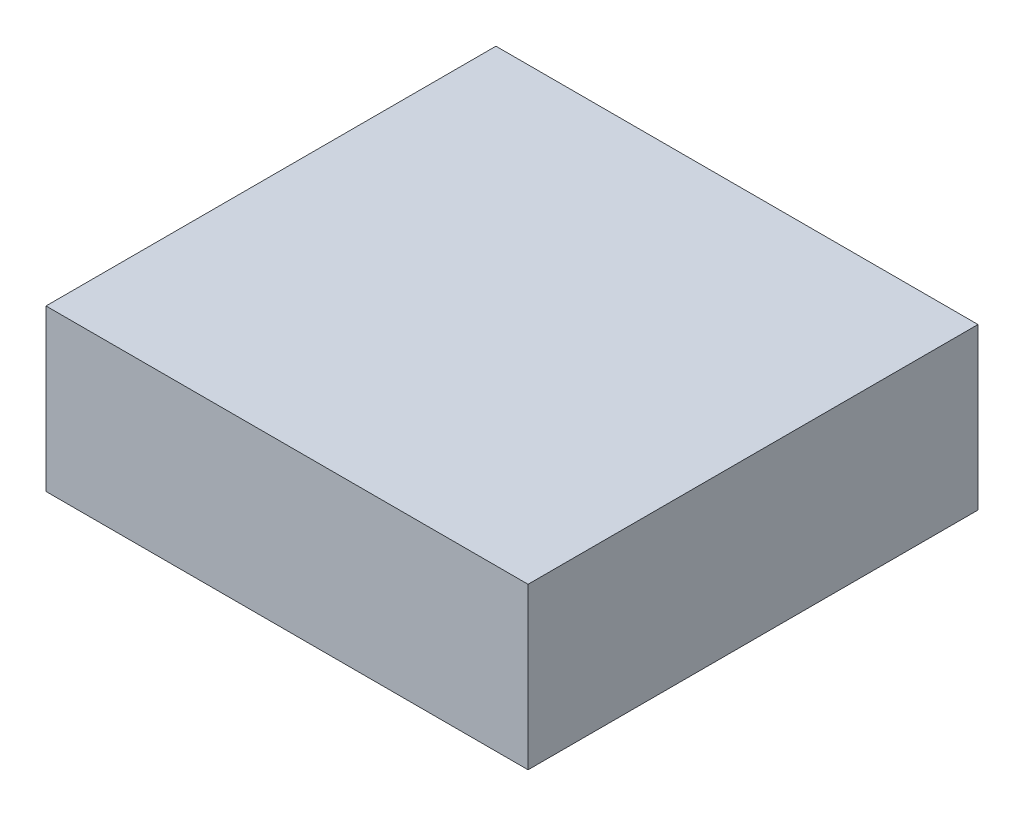
ISO-10303-21;
HEADER;
FILE_DESCRIPTION(('STEP AP214'),'2;1');
FILE_NAME('part.step','',(''),(''),'','','');
FILE_SCHEMA(('AUTOMOTIVE_DESIGN { 1 0 10303 214 1 1 1 1 }'));
ENDSEC;
DATA;
#1=APPLICATION_CONTEXT('core data for automotive mechanical design processes');
#2=APPLICATION_PROTOCOL_DEFINITION('international standard','automotive_design',2000,#1);
#3=PRODUCT_CONTEXT('',#1,'mechanical');
#4=PRODUCT('Part','Part','',(#3));
#5=PRODUCT_RELATED_PRODUCT_CATEGORY('part','',(#4));
#6=PRODUCT_DEFINITION_FORMATION('','',#4);
#7=PRODUCT_DEFINITION_CONTEXT('part definition',#1,'design');
#8=PRODUCT_DEFINITION('design','',#6,#7);
#9=PRODUCT_DEFINITION_SHAPE('','',#8);
#10=(LENGTH_UNIT() NAMED_UNIT(*) SI_UNIT(.MILLI.,.METRE.));
#11=(NAMED_UNIT(*) PLANE_ANGLE_UNIT() SI_UNIT($,.RADIAN.));
#12=(NAMED_UNIT(*) SI_UNIT($,.STERADIAN.) SOLID_ANGLE_UNIT());
#13=UNCERTAINTY_MEASURE_WITH_UNIT(LENGTH_MEASURE(1.E-05),#10,'distance_accuracy_value','');
#14=(GEOMETRIC_REPRESENTATION_CONTEXT(3) GLOBAL_UNCERTAINTY_ASSIGNED_CONTEXT((#13)) GLOBAL_UNIT_ASSIGNED_CONTEXT((#10,
#11,#12)) REPRESENTATION_CONTEXT('',''));
#15=CARTESIAN_POINT('',(0.,0.,0.));
#16=DIRECTION('',(0.,0.,1.));
#17=DIRECTION('',(1.,0.,0.));
#18=AXIS2_PLACEMENT_3D('',#15,#16,#17);
#19=CARTESIAN_POINT('',(227.25,151.5,212.1));
#20=DIRECTION('',(-1.,0.,0.));
#21=DIRECTION('',(0.,0.,1.));
#22=AXIS2_PLACEMENT_3D('',#19,#20,#21);
#23=PLANE('',#22);
#24=DIRECTION('',(0.,0.,-1.));
#25=VECTOR('',#24,1.);
#26=CARTESIAN_POINT('',(227.25,0.,212.1));
#27=LINE('',#26,#25);
#28=CARTESIAN_POINT('',(227.25,0.,212.1));
#29=VERTEX_POINT('',#28);
#30=CARTESIAN_POINT('',(227.25,0.,-212.1));
#31=VERTEX_POINT('',#30);
#32=EDGE_CURVE('E100',#29,#31,#27,.T.);
#33=ORIENTED_EDGE('',*,*,#32,.T.);
#34=DIRECTION('',(0.,-1.,0.));
#35=VECTOR('',#34,1.);
#36=CARTESIAN_POINT('',(227.25,151.5,-212.1));
#37=LINE('',#36,#35);
#38=CARTESIAN_POINT('',(227.25,151.5,-212.1));
#39=VERTEX_POINT('',#38);
#40=EDGE_CURVE('E11',#39,#31,#37,.T.);
#41=ORIENTED_EDGE('',*,*,#40,.F.);
#42=DIRECTION('',(0.,0.,-1.));
#43=VECTOR('',#42,1.);
#44=CARTESIAN_POINT('',(227.25,151.5,212.1));
#45=LINE('',#44,#43);
#46=CARTESIAN_POINT('',(227.25,151.5,212.1));
#47=VERTEX_POINT('',#46);
#48=EDGE_CURVE('E88',#47,#39,#45,.T.);
#49=ORIENTED_EDGE('',*,*,#48,.F.);
#50=DIRECTION('',(0.,-1.,0.));
#51=VECTOR('',#50,1.);
#52=CARTESIAN_POINT('',(227.25,151.5,212.1));
#53=LINE('',#52,#51);
#54=EDGE_CURVE('E96',#47,#29,#53,.T.);
#55=ORIENTED_EDGE('',*,*,#54,.T.);
#56=EDGE_LOOP('',(#33,#41,#49,#55));
#57=FACE_BOUND('',#56,.T.);
#58=ADVANCED_FACE('F37',(#57),#23,.F.);
#59=CARTESIAN_POINT('',(-227.25,151.5,-212.1));
#60=DIRECTION('',(0.,0.,1.));
#61=DIRECTION('',(1.,0.,0.));
#62=AXIS2_PLACEMENT_3D('',#59,#60,#61);
#63=PLANE('',#62);
#64=DIRECTION('',(-1.,0.,0.));
#65=VECTOR('',#64,1.);
#66=CARTESIAN_POINT('',(-227.25,0.,-212.1));
#67=LINE('',#66,#65);
#68=CARTESIAN_POINT('',(-227.25,0.,-212.1));
#69=VERTEX_POINT('',#68);
#70=EDGE_CURVE('E92',#31,#69,#67,.T.);
#71=ORIENTED_EDGE('',*,*,#70,.T.);
#72=DIRECTION('',(0.,-1.,0.));
#73=VECTOR('',#72,1.);
#74=CARTESIAN_POINT('',(-227.25,151.5,-212.1));
#75=LINE('',#74,#73);
#76=CARTESIAN_POINT('',(-227.25,151.5,-212.1));
#77=VERTEX_POINT('',#76);
#78=EDGE_CURVE('E45',#77,#69,#75,.T.);
#79=ORIENTED_EDGE('',*,*,#78,.F.);
#80=DIRECTION('',(-1.,0.,0.));
#81=VECTOR('',#80,1.);
#82=CARTESIAN_POINT('',(-227.25,151.5,-212.1));
#83=LINE('',#82,#81);
#84=EDGE_CURVE('E83',#39,#77,#83,.T.);
#85=ORIENTED_EDGE('',*,*,#84,.F.);
#86=ORIENTED_EDGE('',*,*,#40,.T.);
#87=EDGE_LOOP('',(#71,#79,#85,#86));
#88=FACE_BOUND('',#87,.T.);
#89=ADVANCED_FACE('F91',(#88),#63,.F.);
#90=CARTESIAN_POINT('',(-227.25,151.5,212.1));
#91=DIRECTION('',(1.,0.,0.));
#92=DIRECTION('',(0.,0.,-1.));
#93=AXIS2_PLACEMENT_3D('',#90,#91,#92);
#94=PLANE('',#93);
#95=DIRECTION('',(0.,0.,1.));
#96=VECTOR('',#95,1.);
#97=CARTESIAN_POINT('',(-227.25,0.,212.1));
#98=LINE('',#97,#96);
#99=CARTESIAN_POINT('',(-227.25,0.,212.1));
#100=VERTEX_POINT('',#99);
#101=EDGE_CURVE('E70',#69,#100,#98,.T.);
#102=ORIENTED_EDGE('',*,*,#101,.T.);
#103=DIRECTION('',(0.,-1.,0.));
#104=VECTOR('',#103,1.);
#105=CARTESIAN_POINT('',(-227.25,151.5,212.1));
#106=LINE('',#105,#104);
#107=CARTESIAN_POINT('',(-227.25,151.5,212.1));
#108=VERTEX_POINT('',#107);
#109=EDGE_CURVE('E93',#108,#100,#106,.T.);
#110=ORIENTED_EDGE('',*,*,#109,.F.);
#111=DIRECTION('',(0.,0.,1.));
#112=VECTOR('',#111,1.);
#113=CARTESIAN_POINT('',(-227.25,151.5,212.1));
#114=LINE('',#113,#112);
#115=EDGE_CURVE('E86',#77,#108,#114,.T.);
#116=ORIENTED_EDGE('',*,*,#115,.F.);
#117=ORIENTED_EDGE('',*,*,#78,.T.);
#118=EDGE_LOOP('',(#102,#110,#116,#117));
#119=FACE_BOUND('',#118,.T.);
#120=ADVANCED_FACE('F94',(#119),#94,.F.);
#121=CARTESIAN_POINT('',(-227.25,151.5,212.1));
#122=DIRECTION('',(0.,0.,-1.));
#123=DIRECTION('',(-1.,0.,0.));
#124=AXIS2_PLACEMENT_3D('',#121,#122,#123);
#125=PLANE('',#124);
#126=DIRECTION('',(1.,0.,0.));
#127=VECTOR('',#126,1.);
#128=CARTESIAN_POINT('',(-227.25,0.,212.1));
#129=LINE('',#128,#127);
#130=EDGE_CURVE('E76',#100,#29,#129,.T.);
#131=ORIENTED_EDGE('',*,*,#130,.T.);
#132=ORIENTED_EDGE('',*,*,#54,.F.);
#133=DIRECTION('',(1.,0.,0.));
#134=VECTOR('',#133,1.);
#135=CARTESIAN_POINT('',(-227.25,151.5,212.1));
#136=LINE('',#135,#134);
#137=EDGE_CURVE('E53',#108,#47,#136,.T.);
#138=ORIENTED_EDGE('',*,*,#137,.F.);
#139=ORIENTED_EDGE('',*,*,#109,.T.);
#140=EDGE_LOOP('',(#131,#132,#138,#139));
#141=FACE_BOUND('',#140,.T.);
#142=ADVANCED_FACE('F107',(#141),#125,.F.);
#143=CARTESIAN_POINT('',(0.,151.5,0.));
#144=DIRECTION('',(0.,-1.,0.));
#145=DIRECTION('',(0.,0.,-1.));
#146=AXIS2_PLACEMENT_3D('',#143,#144,#145);
#147=PLANE('',#146);
#148=ORIENTED_EDGE('',*,*,#48,.T.);
#149=ORIENTED_EDGE('',*,*,#84,.T.);
#150=ORIENTED_EDGE('',*,*,#115,.T.);
#151=ORIENTED_EDGE('',*,*,#137,.T.);
#152=EDGE_LOOP('',(#148,#149,#150,#151));
#153=FACE_BOUND('',#152,.T.);
#154=ADVANCED_FACE('F84',(#153),#147,.F.);
#155=CARTESIAN_POINT('',(0.,0.,0.));
#156=DIRECTION('',(0.,-1.,0.));
#157=DIRECTION('',(0.,0.,-1.));
#158=AXIS2_PLACEMENT_3D('',#155,#156,#157);
#159=PLANE('',#158);
#160=ORIENTED_EDGE('',*,*,#32,.F.);
#161=ORIENTED_EDGE('',*,*,#130,.F.);
#162=ORIENTED_EDGE('',*,*,#101,.F.);
#163=ORIENTED_EDGE('',*,*,#70,.F.);
#164=EDGE_LOOP('',(#160,#161,#162,#163));
#165=FACE_BOUND('',#164,.T.);
#166=ADVANCED_FACE('F110',(#165),#159,.T.);
#167=CLOSED_SHELL('',(#58,#89,#120,#142,#154,#166));
#168=MANIFOLD_SOLID_BREP('B2',#167);
#169=ADVANCED_BREP_SHAPE_REPRESENTATION('',(#18,#168),#14);
#170=SHAPE_DEFINITION_REPRESENTATION(#9,#169);
ENDSEC;
END-ISO-10303-21;
